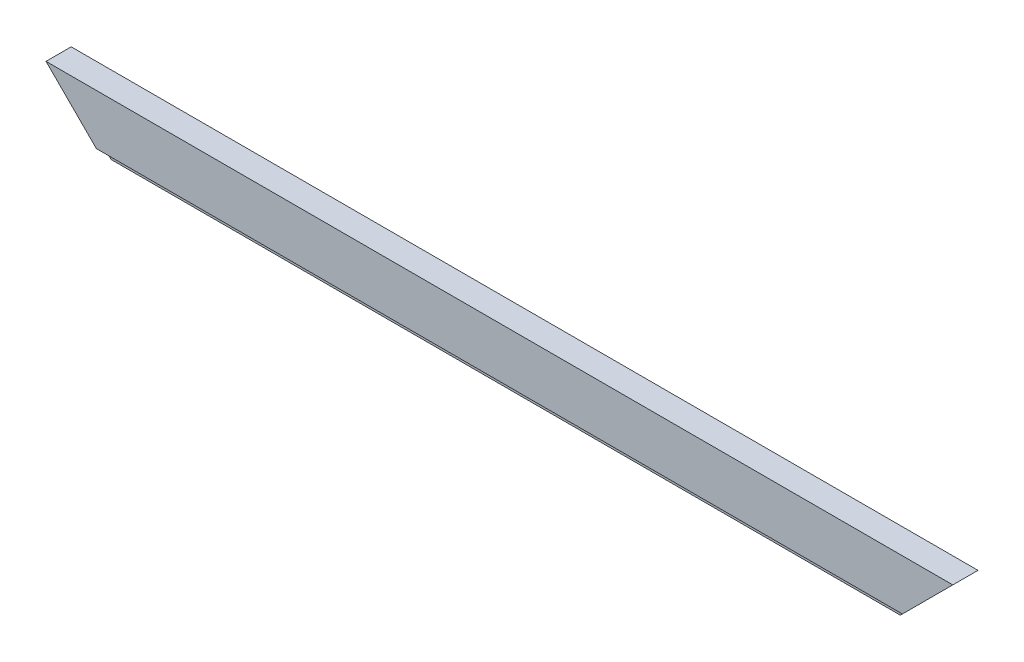
ISO-10303-21;
HEADER;
FILE_DESCRIPTION(('STEP AP214'),'2;1');
FILE_NAME('part.step','',(''),(''),'','','');
FILE_SCHEMA(('AUTOMOTIVE_DESIGN { 1 0 10303 214 1 1 1 1 }'));
ENDSEC;
DATA;
#1=APPLICATION_CONTEXT('core data for automotive mechanical design processes');
#2=APPLICATION_PROTOCOL_DEFINITION('international standard','automotive_design',2000,#1);
#3=PRODUCT_CONTEXT('',#1,'mechanical');
#4=PRODUCT('Part','Part','',(#3));
#5=PRODUCT_RELATED_PRODUCT_CATEGORY('part','',(#4));
#6=PRODUCT_DEFINITION_FORMATION('','',#4);
#7=PRODUCT_DEFINITION_CONTEXT('part definition',#1,'design');
#8=PRODUCT_DEFINITION('design','',#6,#7);
#9=PRODUCT_DEFINITION_SHAPE('','',#8);
#10=(LENGTH_UNIT() NAMED_UNIT(*) SI_UNIT(.MILLI.,.METRE.));
#11=(NAMED_UNIT(*) PLANE_ANGLE_UNIT() SI_UNIT($,.RADIAN.));
#12=(NAMED_UNIT(*) SI_UNIT($,.STERADIAN.) SOLID_ANGLE_UNIT());
#13=UNCERTAINTY_MEASURE_WITH_UNIT(LENGTH_MEASURE(1.E-05),#10,'distance_accuracy_value','');
#14=(GEOMETRIC_REPRESENTATION_CONTEXT(3) GLOBAL_UNCERTAINTY_ASSIGNED_CONTEXT((#13)) GLOBAL_UNIT_ASSIGNED_CONTEXT((#10,
#11,#12)) REPRESENTATION_CONTEXT('',''));
#15=CARTESIAN_POINT('',(0.,0.,0.));
#16=DIRECTION('',(0.,0.,1.));
#17=DIRECTION('',(1.,0.,0.));
#18=AXIS2_PLACEMENT_3D('',#15,#16,#17);
#19=CARTESIAN_POINT('',(0.,0.,38.1));
#20=DIRECTION('',(0.,1.,0.));
#21=DIRECTION('',(0.,0.,1.));
#22=AXIS2_PLACEMENT_3D('',#19,#20,#21);
#23=PLANE('',#22);
#24=DIRECTION('',(0.,0.,1.));
#25=VECTOR('',#24,1.);
#26=CARTESIAN_POINT('',(1282.7,0.,-0.001000000000001));
#27=LINE('',#26,#25);
#28=CARTESIAN_POINT('',(1282.7,0.,0.));
#29=VERTEX_POINT('',#28);
#30=CARTESIAN_POINT('',(1282.7,0.,28.575));
#31=VERTEX_POINT('',#30);
#32=EDGE_CURVE('E58',#29,#31,#27,.T.);
#33=ORIENTED_EDGE('',*,*,#32,.T.);
#34=DIRECTION('',(1.,0.,0.));
#35=VECTOR('',#34,1.);
#36=CARTESIAN_POINT('',(88.9000000000022,0.,28.575));
#37=LINE('',#36,#35);
#38=CARTESIAN_POINT('',(88.9000000000022,0.,28.575));
#39=VERTEX_POINT('',#38);
#40=EDGE_CURVE('E51',#39,#31,#37,.T.);
#41=ORIENTED_EDGE('',*,*,#40,.F.);
#42=DIRECTION('',(0.,0.,1.));
#43=VECTOR('',#42,1.);
#44=CARTESIAN_POINT('',(88.9000000000022,0.,-0.001000000000001));
#45=LINE('',#44,#43);
#46=CARTESIAN_POINT('',(88.9000000000022,0.,0.));
#47=VERTEX_POINT('',#46);
#48=EDGE_CURVE('E100',#47,#39,#45,.T.);
#49=ORIENTED_EDGE('',*,*,#48,.F.);
#50=DIRECTION('',(1.,0.,0.));
#51=VECTOR('',#50,1.);
#52=CARTESIAN_POINT('',(0.,0.,0.));
#53=LINE('',#52,#51);
#54=EDGE_CURVE('E107',#47,#29,#53,.T.);
#55=ORIENTED_EDGE('',*,*,#54,.T.);
#56=EDGE_LOOP('',(#33,#41,#49,#55));
#57=FACE_BOUND('',#56,.T.);
#58=ADVANCED_FACE('F37',(#57),#23,.F.);
#59=CARTESIAN_POINT('',(0.,88.9,38.1));
#60=DIRECTION('',(0.,-1.,0.));
#61=DIRECTION('',(0.,0.,-1.));
#62=AXIS2_PLACEMENT_3D('',#59,#60,#61);
#63=PLANE('',#62);
#64=DIRECTION('',(-1.,0.,0.));
#65=VECTOR('',#64,1.);
#66=CARTESIAN_POINT('',(0.,88.9,0.));
#67=LINE('',#66,#65);
#68=CARTESIAN_POINT('',(1371.6,88.9,0.));
#69=VERTEX_POINT('',#68);
#70=CARTESIAN_POINT('',(0.,88.9,0.));
#71=VERTEX_POINT('',#70);
#72=EDGE_CURVE('E110',#69,#71,#67,.T.);
#73=ORIENTED_EDGE('',*,*,#72,.T.);
#74=DIRECTION('',(0.,0.,-1.));
#75=VECTOR('',#74,1.);
#76=CARTESIAN_POINT('',(0.,88.9,38.1));
#77=LINE('',#76,#75);
#78=CARTESIAN_POINT('',(0.,88.9,38.1));
#79=VERTEX_POINT('',#78);
#80=EDGE_CURVE('E44',#79,#71,#77,.T.);
#81=ORIENTED_EDGE('',*,*,#80,.F.);
#82=DIRECTION('',(-1.,0.,0.));
#83=VECTOR('',#82,1.);
#84=CARTESIAN_POINT('',(0.,88.9,38.1));
#85=LINE('',#84,#83);
#86=CARTESIAN_POINT('',(1371.6,88.9,38.1));
#87=VERTEX_POINT('',#86);
#88=EDGE_CURVE('E115',#87,#79,#85,.T.);
#89=ORIENTED_EDGE('',*,*,#88,.F.);
#90=DIRECTION('',(0.,0.,-1.));
#91=VECTOR('',#90,1.);
#92=CARTESIAN_POINT('',(1371.6,88.9,38.1));
#93=LINE('',#92,#91);
#94=EDGE_CURVE('E11',#87,#69,#93,.T.);
#95=ORIENTED_EDGE('',*,*,#94,.T.);
#96=EDGE_LOOP('',(#73,#81,#89,#95));
#97=FACE_BOUND('',#96,.T.);
#98=ADVANCED_FACE('F127',(#97),#63,.F.);
#99=CARTESIAN_POINT('',(0.,0.,38.1));
#100=DIRECTION('',(0.,0.,-1.));
#101=DIRECTION('',(-1.,0.,0.));
#102=AXIS2_PLACEMENT_3D('',#99,#100,#101);
#103=PLANE('',#102);
#104=DIRECTION('',(-0.707106781186556,0.707106781186539,0.));
#105=VECTOR('',#104,1.);
#106=CARTESIAN_POINT('',(0.,88.9,38.1));
#107=LINE('',#106,#105);
#108=CARTESIAN_POINT('',(76.2000000000021,12.7,38.1));
#109=VERTEX_POINT('',#108);
#110=EDGE_CURVE('E108',#109,#79,#107,.T.);
#111=ORIENTED_EDGE('',*,*,#110,.F.);
#112=DIRECTION('',(-1.,0.,0.));
#113=VECTOR('',#112,1.);
#114=CARTESIAN_POINT('',(76.2000000000021,12.7,38.1));
#115=LINE('',#114,#113);
#116=CARTESIAN_POINT('',(1295.4,12.7,38.1));
#117=VERTEX_POINT('',#116);
#118=EDGE_CURVE('E95',#117,#109,#115,.T.);
#119=ORIENTED_EDGE('',*,*,#118,.F.);
#120=DIRECTION('',(-0.707106781186547,-0.707106781186547,0.));
#121=VECTOR('',#120,1.);
#122=CARTESIAN_POINT('',(1371.6,88.9,38.1));
#123=LINE('',#122,#121);
#124=EDGE_CURVE('E132',#87,#117,#123,.T.);
#125=ORIENTED_EDGE('',*,*,#124,.F.);
#126=ORIENTED_EDGE('',*,*,#88,.T.);
#127=EDGE_LOOP('',(#111,#119,#125,#126));
#128=FACE_BOUND('',#127,.T.);
#129=ADVANCED_FACE('F135',(#128),#103,.F.);
#130=CARTESIAN_POINT('',(0.,0.,0.));
#131=DIRECTION('',(0.,0.,-1.));
#132=DIRECTION('',(-1.,0.,0.));
#133=AXIS2_PLACEMENT_3D('',#130,#131,#132);
#134=PLANE('',#133);
#135=DIRECTION('',(-0.707106781186547,-0.707106781186548,0.));
#136=VECTOR('',#135,1.);
#137=CARTESIAN_POINT('',(1371.6,88.9,0.));
#138=LINE('',#137,#136);
#139=EDGE_CURVE('E126',#69,#29,#138,.T.);
#140=ORIENTED_EDGE('',*,*,#139,.T.);
#141=ORIENTED_EDGE('',*,*,#54,.F.);
#142=DIRECTION('',(-0.707106781186556,0.707106781186539,0.));
#143=VECTOR('',#142,1.);
#144=CARTESIAN_POINT('',(0.,88.9,0.));
#145=LINE('',#144,#143);
#146=EDGE_CURVE('E106',#47,#71,#145,.T.);
#147=ORIENTED_EDGE('',*,*,#146,.T.);
#148=ORIENTED_EDGE('',*,*,#72,.F.);
#149=EDGE_LOOP('',(#140,#141,#147,#148));
#150=FACE_BOUND('',#149,.T.);
#151=ADVANCED_FACE('F125',(#150),#134,.T.);
#152=CARTESIAN_POINT('',(0.,88.9,-0.001000000000001));
#153=DIRECTION('',(0.707106781186539,0.707106781186556,0.));
#154=DIRECTION('',(-0.707106781186556,0.707106781186539,0.));
#155=AXIS2_PLACEMENT_3D('',#152,#153,#154);
#156=PLANE('',#155);
#157=DIRECTION('',(0.707106781186547,-0.707106781186547,0.));
#158=VECTOR('',#157,1.);
#159=CARTESIAN_POINT('',(88.9000000000022,0.,28.575));
#160=LINE('',#159,#158);
#161=CARTESIAN_POINT('',(76.2000000000021,12.7,28.575));
#162=VERTEX_POINT('',#161);
#163=EDGE_CURVE('E88',#162,#39,#160,.T.);
#164=ORIENTED_EDGE('',*,*,#163,.F.);
#165=DIRECTION('',(0.,0.,1.));
#166=VECTOR('',#165,1.);
#167=CARTESIAN_POINT('',(76.2000000000021,12.7,28.575));
#168=LINE('',#167,#166);
#169=EDGE_CURVE('E136',#162,#109,#168,.T.);
#170=ORIENTED_EDGE('',*,*,#169,.T.);
#171=ORIENTED_EDGE('',*,*,#110,.T.);
#172=ORIENTED_EDGE('',*,*,#80,.T.);
#173=ORIENTED_EDGE('',*,*,#146,.F.);
#174=ORIENTED_EDGE('',*,*,#48,.T.);
#175=EDGE_LOOP('',(#164,#170,#171,#172,#173,#174));
#176=FACE_BOUND('',#175,.T.);
#177=ADVANCED_FACE('F104',(#176),#156,.F.);
#178=CARTESIAN_POINT('',(1371.6,88.9,-0.001000000000001));
#179=DIRECTION('',(-0.707106781186548,0.707106781186547,0.));
#180=DIRECTION('',(-0.707106781186547,-0.707106781186548,0.));
#181=AXIS2_PLACEMENT_3D('',#178,#179,#180);
#182=PLANE('',#181);
#183=ORIENTED_EDGE('',*,*,#124,.T.);
#184=DIRECTION('',(0.,0.,1.));
#185=VECTOR('',#184,1.);
#186=CARTESIAN_POINT('',(1295.4,12.7,28.575));
#187=LINE('',#186,#185);
#188=CARTESIAN_POINT('',(1295.4,12.7,28.575));
#189=VERTEX_POINT('',#188);
#190=EDGE_CURVE('E139',#189,#117,#187,.T.);
#191=ORIENTED_EDGE('',*,*,#190,.F.);
#192=DIRECTION('',(0.707106781186546,0.707106781186549,0.));
#193=VECTOR('',#192,1.);
#194=CARTESIAN_POINT('',(1282.7,0.,28.575));
#195=LINE('',#194,#193);
#196=EDGE_CURVE('E102',#31,#189,#195,.T.);
#197=ORIENTED_EDGE('',*,*,#196,.F.);
#198=ORIENTED_EDGE('',*,*,#32,.F.);
#199=ORIENTED_EDGE('',*,*,#139,.F.);
#200=ORIENTED_EDGE('',*,*,#94,.F.);
#201=EDGE_LOOP('',(#183,#191,#197,#198,#199,#200));
#202=FACE_BOUND('',#201,.T.);
#203=ADVANCED_FACE('F130',(#202),#182,.F.);
#204=CARTESIAN_POINT('',(76.2000000000021,12.7,28.575));
#205=DIRECTION('',(0.,1.,0.));
#206=DIRECTION('',(0.,0.,1.));
#207=AXIS2_PLACEMENT_3D('',#204,#205,#206);
#208=PLANE('',#207);
#209=ORIENTED_EDGE('',*,*,#118,.T.);
#210=ORIENTED_EDGE('',*,*,#169,.F.);
#211=DIRECTION('',(-1.,0.,0.));
#212=VECTOR('',#211,1.);
#213=CARTESIAN_POINT('',(76.2000000000021,12.7,28.575));
#214=LINE('',#213,#212);
#215=EDGE_CURVE('E91',#189,#162,#214,.T.);
#216=ORIENTED_EDGE('',*,*,#215,.F.);
#217=ORIENTED_EDGE('',*,*,#190,.T.);
#218=EDGE_LOOP('',(#209,#210,#216,#217));
#219=FACE_BOUND('',#218,.T.);
#220=ADVANCED_FACE('F147',(#219),#208,.F.);
#221=CARTESIAN_POINT('',(0.,0.,28.575));
#222=DIRECTION('',(0.,0.,-1.));
#223=DIRECTION('',(-1.,0.,0.));
#224=AXIS2_PLACEMENT_3D('',#221,#222,#223);
#225=PLANE('',#224);
#226=ORIENTED_EDGE('',*,*,#163,.T.);
#227=ORIENTED_EDGE('',*,*,#40,.T.);
#228=ORIENTED_EDGE('',*,*,#196,.T.);
#229=ORIENTED_EDGE('',*,*,#215,.T.);
#230=EDGE_LOOP('',(#226,#227,#228,#229));
#231=FACE_BOUND('',#230,.T.);
#232=ADVANCED_FACE('F89',(#231),#225,.F.);
#233=CLOSED_SHELL('',(#58,#98,#129,#151,#177,#203,#220,#232));
#234=MANIFOLD_SOLID_BREP('B2',#233);
#235=ADVANCED_BREP_SHAPE_REPRESENTATION('',(#18,#234),#14);
#236=SHAPE_DEFINITION_REPRESENTATION(#9,#235);
ENDSEC;
END-ISO-10303-21;
